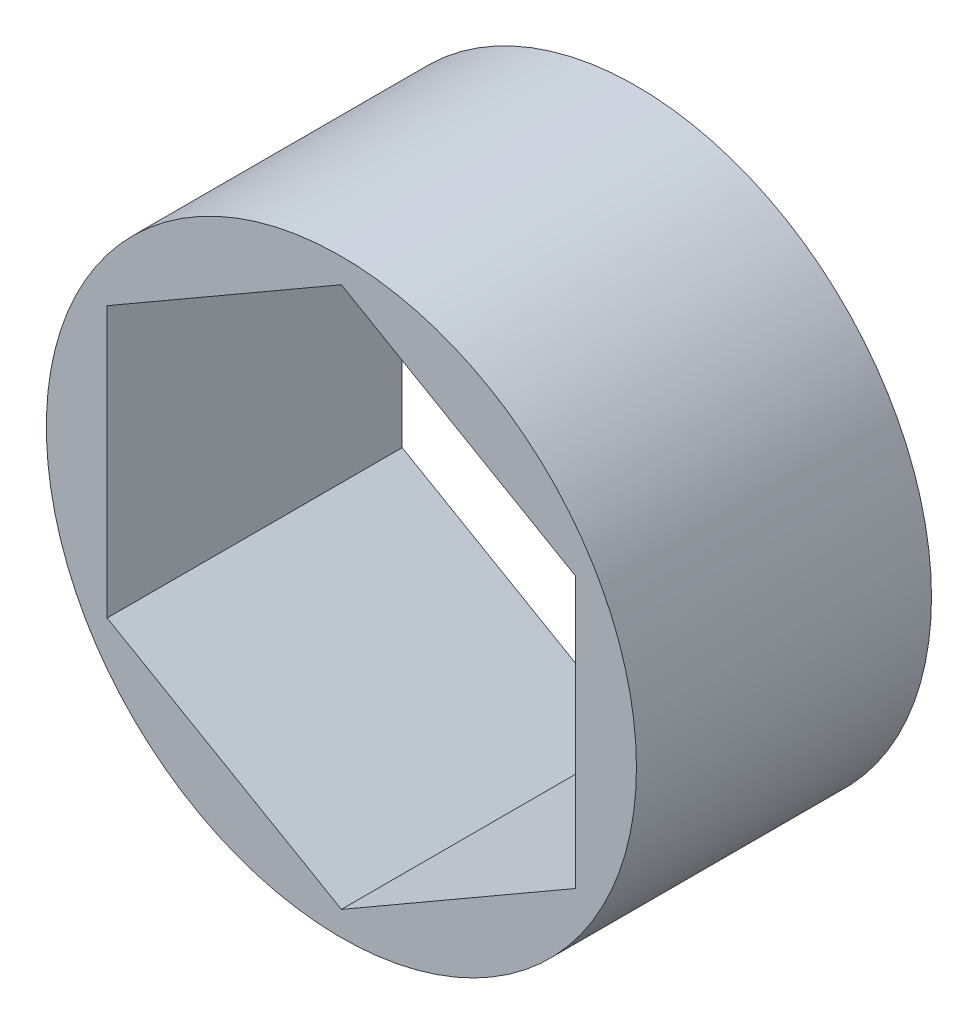
ISO-10303-21;
HEADER;
FILE_DESCRIPTION(('STEP AP214'),'2;1');
FILE_NAME('part.step','',(''),(''),'','','');
FILE_SCHEMA(('AUTOMOTIVE_DESIGN { 1 0 10303 214 1 1 1 1 }'));
ENDSEC;
DATA;
#1=APPLICATION_CONTEXT('core data for automotive mechanical design processes');
#2=APPLICATION_PROTOCOL_DEFINITION('international standard','automotive_design',2000,#1);
#3=PRODUCT_CONTEXT('',#1,'mechanical');
#4=PRODUCT('Part','Part','',(#3));
#5=PRODUCT_RELATED_PRODUCT_CATEGORY('part','',(#4));
#6=PRODUCT_DEFINITION_FORMATION('','',#4);
#7=PRODUCT_DEFINITION_CONTEXT('part definition',#1,'design');
#8=PRODUCT_DEFINITION('design','',#6,#7);
#9=PRODUCT_DEFINITION_SHAPE('','',#8);
#10=(LENGTH_UNIT() NAMED_UNIT(*) SI_UNIT(.MILLI.,.METRE.));
#11=(NAMED_UNIT(*) PLANE_ANGLE_UNIT() SI_UNIT($,.RADIAN.));
#12=(NAMED_UNIT(*) SI_UNIT($,.STERADIAN.) SOLID_ANGLE_UNIT());
#13=UNCERTAINTY_MEASURE_WITH_UNIT(LENGTH_MEASURE(1.E-05),#10,'distance_accuracy_value','');
#14=(GEOMETRIC_REPRESENTATION_CONTEXT(3) GLOBAL_UNCERTAINTY_ASSIGNED_CONTEXT((#13)) GLOBAL_UNIT_ASSIGNED_CONTEXT((#10,
#11,#12)) REPRESENTATION_CONTEXT('',''));
#15=CARTESIAN_POINT('',(0.,0.,0.));
#16=DIRECTION('',(0.,0.,1.));
#17=DIRECTION('',(1.,0.,0.));
#18=AXIS2_PLACEMENT_3D('',#15,#16,#17);
#19=CARTESIAN_POINT('',(0.,0.,6.));
#20=DIRECTION('',(0.,0.,-1.));
#21=DIRECTION('',(-1.,0.,0.));
#22=AXIS2_PLACEMENT_3D('',#19,#20,#21);
#23=CYLINDRICAL_SURFACE('',#22,12.);
#24=CARTESIAN_POINT('',(0.,0.,6.));
#25=DIRECTION('',(0.,0.,1.));
#26=DIRECTION('',(1.,0.,0.));
#27=AXIS2_PLACEMENT_3D('',#24,#25,#26);
#28=CIRCLE('',#27,12.);
#29=CARTESIAN_POINT('',(12.,0.,6.));
#30=VERTEX_POINT('',#29);
#31=EDGE_CURVE('E11',#30,#30,#28,.T.);
#32=ORIENTED_EDGE('',*,*,#31,.F.);
#33=EDGE_LOOP('',(#32));
#34=FACE_BOUND('',#33,.T.);
#35=CARTESIAN_POINT('',(0.,0.,-6.));
#36=DIRECTION('',(0.,0.,1.));
#37=DIRECTION('',(1.,0.,0.));
#38=AXIS2_PLACEMENT_3D('',#35,#36,#37);
#39=CIRCLE('',#38,12.);
#40=CARTESIAN_POINT('',(12.,0.,-6.));
#41=VERTEX_POINT('',#40);
#42=EDGE_CURVE('E40',#41,#41,#39,.T.);
#43=ORIENTED_EDGE('',*,*,#42,.T.);
#44=EDGE_LOOP('',(#43));
#45=FACE_BOUND('',#44,.T.);
#46=ADVANCED_FACE('F37',(#34,#45),#23,.T.);
#47=CARTESIAN_POINT('',(0.,0.,6.));
#48=DIRECTION('',(0.,0.,1.));
#49=DIRECTION('',(1.,0.,0.));
#50=AXIS2_PLACEMENT_3D('',#47,#48,#49);
#51=PLANE('',#50);
#52=DIRECTION('',(0.,-1.,0.));
#53=VECTOR('',#52,1.);
#54=CARTESIAN_POINT('',(-9.52627944162882,0.,6.));
#55=LINE('',#54,#53);
#56=CARTESIAN_POINT('',(-9.52627944162882,5.5,6.));
#57=VERTEX_POINT('',#56);
#58=CARTESIAN_POINT('',(-9.52627944162882,-5.50000000000001,6.));
#59=VERTEX_POINT('',#58);
#60=EDGE_CURVE('E51',#57,#59,#55,.T.);
#61=ORIENTED_EDGE('',*,*,#60,.F.);
#62=DIRECTION('',(-0.866025403784439,-0.5,0.));
#63=VECTOR('',#62,1.);
#64=CARTESIAN_POINT('',(-4.76313972081441,8.25,6.));
#65=LINE('',#64,#63);
#66=CARTESIAN_POINT('',(0.,11.,6.));
#67=VERTEX_POINT('',#66);
#68=EDGE_CURVE('E116',#67,#57,#65,.T.);
#69=ORIENTED_EDGE('',*,*,#68,.F.);
#70=DIRECTION('',(-0.866025403784439,0.5,0.));
#71=VECTOR('',#70,1.);
#72=CARTESIAN_POINT('',(4.76313972081441,8.25,6.));
#73=LINE('',#72,#71);
#74=CARTESIAN_POINT('',(9.52627944162882,5.5,6.));
#75=VERTEX_POINT('',#74);
#76=EDGE_CURVE('E110',#75,#67,#73,.T.);
#77=ORIENTED_EDGE('',*,*,#76,.F.);
#78=DIRECTION('',(0.,1.,0.));
#79=VECTOR('',#78,1.);
#80=CARTESIAN_POINT('',(9.52627944162882,0.,6.));
#81=LINE('',#80,#79);
#82=CARTESIAN_POINT('',(9.52627944162883,-5.5,6.));
#83=VERTEX_POINT('',#82);
#84=EDGE_CURVE('E108',#83,#75,#81,.T.);
#85=ORIENTED_EDGE('',*,*,#84,.F.);
#86=DIRECTION('',(0.866025403784439,0.5,0.));
#87=VECTOR('',#86,1.);
#88=CARTESIAN_POINT('',(4.76313972081441,-8.25,6.));
#89=LINE('',#88,#87);
#90=CARTESIAN_POINT('',(0.,-11.,6.));
#91=VERTEX_POINT('',#90);
#92=EDGE_CURVE('E91',#91,#83,#89,.T.);
#93=ORIENTED_EDGE('',*,*,#92,.F.);
#94=DIRECTION('',(0.866025403784439,-0.5,0.));
#95=VECTOR('',#94,1.);
#96=CARTESIAN_POINT('',(-4.76313972081441,-8.25,6.));
#97=LINE('',#96,#95);
#98=EDGE_CURVE('E100',#59,#91,#97,.T.);
#99=ORIENTED_EDGE('',*,*,#98,.F.);
#100=EDGE_LOOP('',(#61,#69,#77,#85,#93,#99));
#101=FACE_BOUND('',#100,.T.);
#102=ORIENTED_EDGE('',*,*,#31,.T.);
#103=EDGE_LOOP('',(#102));
#104=FACE_BOUND('',#103,.T.);
#105=ADVANCED_FACE('F104',(#101,#104),#51,.T.);
#106=CARTESIAN_POINT('',(0.,0.,-6.));
#107=DIRECTION('',(0.,0.,1.));
#108=DIRECTION('',(1.,0.,0.));
#109=AXIS2_PLACEMENT_3D('',#106,#107,#108);
#110=PLANE('',#109);
#111=DIRECTION('',(-0.866025403784439,-0.5,0.));
#112=VECTOR('',#111,1.);
#113=CARTESIAN_POINT('',(-4.76313972081441,8.25,-6.));
#114=LINE('',#113,#112);
#115=CARTESIAN_POINT('',(0.,11.,-6.));
#116=VERTEX_POINT('',#115);
#117=CARTESIAN_POINT('',(-9.52627944162882,5.5,-6.));
#118=VERTEX_POINT('',#117);
#119=EDGE_CURVE('E131',#116,#118,#114,.T.);
#120=ORIENTED_EDGE('',*,*,#119,.T.);
#121=DIRECTION('',(0.,-1.,0.));
#122=VECTOR('',#121,1.);
#123=CARTESIAN_POINT('',(-9.52627944162882,0.,-6.));
#124=LINE('',#123,#122);
#125=CARTESIAN_POINT('',(-9.52627944162882,-5.5,-6.));
#126=VERTEX_POINT('',#125);
#127=EDGE_CURVE('E119',#118,#126,#124,.T.);
#128=ORIENTED_EDGE('',*,*,#127,.T.);
#129=DIRECTION('',(0.866025403784439,-0.5,0.));
#130=VECTOR('',#129,1.);
#131=CARTESIAN_POINT('',(-4.76313972081441,-8.25,-6.));
#132=LINE('',#131,#130);
#133=CARTESIAN_POINT('',(0.,-11.,-6.));
#134=VERTEX_POINT('',#133);
#135=EDGE_CURVE('E122',#126,#134,#132,.T.);
#136=ORIENTED_EDGE('',*,*,#135,.T.);
#137=DIRECTION('',(0.866025403784439,0.5,0.));
#138=VECTOR('',#137,1.);
#139=CARTESIAN_POINT('',(4.76313972081441,-8.25,-6.));
#140=LINE('',#139,#138);
#141=CARTESIAN_POINT('',(9.52627944162883,-5.5,-6.));
#142=VERTEX_POINT('',#141);
#143=EDGE_CURVE('E59',#134,#142,#140,.T.);
#144=ORIENTED_EDGE('',*,*,#143,.T.);
#145=DIRECTION('',(0.,1.,0.));
#146=VECTOR('',#145,1.);
#147=CARTESIAN_POINT('',(9.52627944162882,0.,-6.));
#148=LINE('',#147,#146);
#149=CARTESIAN_POINT('',(9.52627944162882,5.5,-6.));
#150=VERTEX_POINT('',#149);
#151=EDGE_CURVE('E125',#142,#150,#148,.T.);
#152=ORIENTED_EDGE('',*,*,#151,.T.);
#153=DIRECTION('',(-0.866025403784439,0.5,0.));
#154=VECTOR('',#153,1.);
#155=CARTESIAN_POINT('',(4.76313972081441,8.25,-6.));
#156=LINE('',#155,#154);
#157=EDGE_CURVE('E128',#150,#116,#156,.T.);
#158=ORIENTED_EDGE('',*,*,#157,.T.);
#159=EDGE_LOOP('',(#120,#128,#136,#144,#152,#158));
#160=FACE_BOUND('',#159,.T.);
#161=ORIENTED_EDGE('',*,*,#42,.F.);
#162=EDGE_LOOP('',(#161));
#163=FACE_BOUND('',#162,.T.);
#164=ADVANCED_FACE('F146',(#160,#163),#110,.F.);
#165=CARTESIAN_POINT('',(-9.52627944162882,0.,-6.));
#166=DIRECTION('',(-1.,0.,0.));
#167=DIRECTION('',(0.,-1.,0.));
#168=AXIS2_PLACEMENT_3D('',#165,#166,#167);
#169=PLANE('',#168);
#170=DIRECTION('',(0.,0.,1.));
#171=VECTOR('',#170,1.);
#172=CARTESIAN_POINT('',(-9.52627944162882,-5.5,-6.));
#173=LINE('',#172,#171);
#174=EDGE_CURVE('E97',#126,#59,#173,.T.);
#175=ORIENTED_EDGE('',*,*,#174,.F.);
#176=ORIENTED_EDGE('',*,*,#127,.F.);
#177=DIRECTION('',(0.,0.,1.));
#178=VECTOR('',#177,1.);
#179=CARTESIAN_POINT('',(-9.52627944162882,5.5,-6.));
#180=LINE('',#179,#178);
#181=EDGE_CURVE('E134',#118,#57,#180,.T.);
#182=ORIENTED_EDGE('',*,*,#181,.T.);
#183=ORIENTED_EDGE('',*,*,#60,.T.);
#184=EDGE_LOOP('',(#175,#176,#182,#183));
#185=FACE_BOUND('',#184,.T.);
#186=ADVANCED_FACE('F150',(#185),#169,.F.);
#187=CARTESIAN_POINT('',(-4.76313972081441,8.25,-6.));
#188=DIRECTION('',(-0.5,0.866025403784439,0.));
#189=DIRECTION('',(-0.866025403784439,-0.5,0.));
#190=AXIS2_PLACEMENT_3D('',#187,#188,#189);
#191=PLANE('',#190);
#192=ORIENTED_EDGE('',*,*,#181,.F.);
#193=ORIENTED_EDGE('',*,*,#119,.F.);
#194=DIRECTION('',(0.,0.,1.));
#195=VECTOR('',#194,1.);
#196=CARTESIAN_POINT('',(0.,11.,-6.));
#197=LINE('',#196,#195);
#198=EDGE_CURVE('E136',#116,#67,#197,.T.);
#199=ORIENTED_EDGE('',*,*,#198,.T.);
#200=ORIENTED_EDGE('',*,*,#68,.T.);
#201=EDGE_LOOP('',(#192,#193,#199,#200));
#202=FACE_BOUND('',#201,.T.);
#203=ADVANCED_FACE('F153',(#202),#191,.F.);
#204=CARTESIAN_POINT('',(4.76313972081441,8.25,-6.));
#205=DIRECTION('',(0.5,0.866025403784439,0.));
#206=DIRECTION('',(-0.866025403784439,0.5,0.));
#207=AXIS2_PLACEMENT_3D('',#204,#205,#206);
#208=PLANE('',#207);
#209=ORIENTED_EDGE('',*,*,#198,.F.);
#210=ORIENTED_EDGE('',*,*,#157,.F.);
#211=DIRECTION('',(0.,0.,1.));
#212=VECTOR('',#211,1.);
#213=CARTESIAN_POINT('',(9.52627944162882,5.5,-6.));
#214=LINE('',#213,#212);
#215=EDGE_CURVE('E138',#150,#75,#214,.T.);
#216=ORIENTED_EDGE('',*,*,#215,.T.);
#217=ORIENTED_EDGE('',*,*,#76,.T.);
#218=EDGE_LOOP('',(#209,#210,#216,#217));
#219=FACE_BOUND('',#218,.T.);
#220=ADVANCED_FACE('F155',(#219),#208,.F.);
#221=CARTESIAN_POINT('',(9.52627944162882,0.,-6.));
#222=DIRECTION('',(1.,0.,0.));
#223=DIRECTION('',(0.,1.,0.));
#224=AXIS2_PLACEMENT_3D('',#221,#222,#223);
#225=PLANE('',#224);
#226=ORIENTED_EDGE('',*,*,#215,.F.);
#227=ORIENTED_EDGE('',*,*,#151,.F.);
#228=DIRECTION('',(0.,0.,1.));
#229=VECTOR('',#228,1.);
#230=CARTESIAN_POINT('',(9.52627944162883,-5.5,-6.));
#231=LINE('',#230,#229);
#232=EDGE_CURVE('E96',#142,#83,#231,.T.);
#233=ORIENTED_EDGE('',*,*,#232,.T.);
#234=ORIENTED_EDGE('',*,*,#84,.T.);
#235=EDGE_LOOP('',(#226,#227,#233,#234));
#236=FACE_BOUND('',#235,.T.);
#237=ADVANCED_FACE('F143',(#236),#225,.F.);
#238=CARTESIAN_POINT('',(4.76313972081441,-8.25,-6.));
#239=DIRECTION('',(0.5,-0.866025403784439,0.));
#240=DIRECTION('',(0.866025403784439,0.5,0.));
#241=AXIS2_PLACEMENT_3D('',#238,#239,#240);
#242=PLANE('',#241);
#243=ORIENTED_EDGE('',*,*,#232,.F.);
#244=ORIENTED_EDGE('',*,*,#143,.F.);
#245=DIRECTION('',(0.,0.,1.));
#246=VECTOR('',#245,1.);
#247=CARTESIAN_POINT('',(0.,-11.,-6.));
#248=LINE('',#247,#246);
#249=EDGE_CURVE('E87',#134,#91,#248,.T.);
#250=ORIENTED_EDGE('',*,*,#249,.T.);
#251=ORIENTED_EDGE('',*,*,#92,.T.);
#252=EDGE_LOOP('',(#243,#244,#250,#251));
#253=FACE_BOUND('',#252,.T.);
#254=ADVANCED_FACE('F89',(#253),#242,.F.);
#255=CARTESIAN_POINT('',(-4.76313972081441,-8.25,-6.));
#256=DIRECTION('',(-0.5,-0.866025403784439,0.));
#257=DIRECTION('',(0.866025403784439,-0.5,0.));
#258=AXIS2_PLACEMENT_3D('',#255,#256,#257);
#259=PLANE('',#258);
#260=ORIENTED_EDGE('',*,*,#249,.F.);
#261=ORIENTED_EDGE('',*,*,#135,.F.);
#262=ORIENTED_EDGE('',*,*,#174,.T.);
#263=ORIENTED_EDGE('',*,*,#98,.T.);
#264=EDGE_LOOP('',(#260,#261,#262,#263));
#265=FACE_BOUND('',#264,.T.);
#266=ADVANCED_FACE('F101',(#265),#259,.F.);
#267=CLOSED_SHELL('',(#46,#105,#164,#186,#203,#220,#237,#254,#266));
#268=MANIFOLD_SOLID_BREP('B2',#267);
#269=ADVANCED_BREP_SHAPE_REPRESENTATION('',(#18,#268),#14);
#270=SHAPE_DEFINITION_REPRESENTATION(#9,#269);
ENDSEC;
END-ISO-10303-21;
